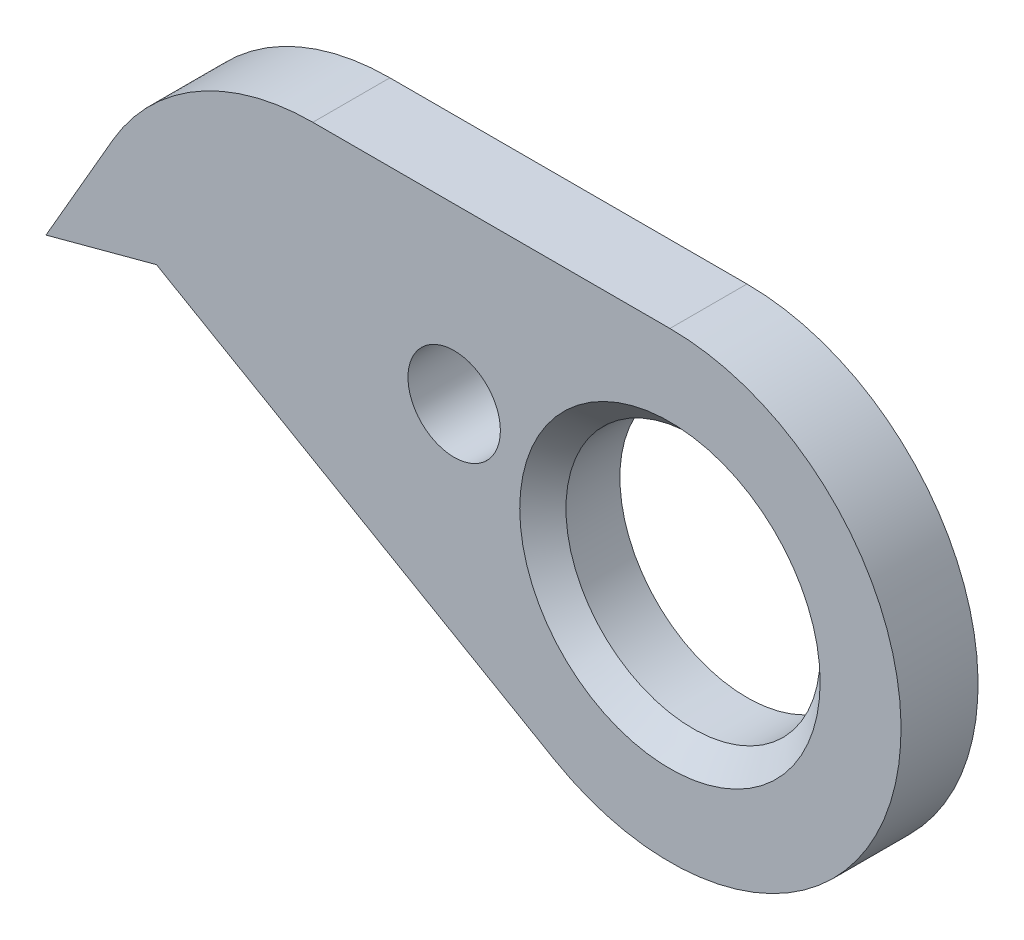
ISO-10303-21;
HEADER;
FILE_DESCRIPTION(('STEP AP214'),'2;1');
FILE_NAME('part.step','',(''),(''),'','','');
FILE_SCHEMA(('AUTOMOTIVE_DESIGN { 1 0 10303 214 1 1 1 1 }'));
ENDSEC;
DATA;
#1=APPLICATION_CONTEXT('core data for automotive mechanical design processes');
#2=APPLICATION_PROTOCOL_DEFINITION('international standard','automotive_design',2000,#1);
#3=PRODUCT_CONTEXT('',#1,'mechanical');
#4=PRODUCT('Part','Part','',(#3));
#5=PRODUCT_RELATED_PRODUCT_CATEGORY('part','',(#4));
#6=PRODUCT_DEFINITION_FORMATION('','',#4);
#7=PRODUCT_DEFINITION_CONTEXT('part definition',#1,'design');
#8=PRODUCT_DEFINITION('design','',#6,#7);
#9=PRODUCT_DEFINITION_SHAPE('','',#8);
#10=(LENGTH_UNIT() NAMED_UNIT(*) SI_UNIT(.MILLI.,.METRE.));
#11=(NAMED_UNIT(*) PLANE_ANGLE_UNIT() SI_UNIT($,.RADIAN.));
#12=(NAMED_UNIT(*) SI_UNIT($,.STERADIAN.) SOLID_ANGLE_UNIT());
#13=UNCERTAINTY_MEASURE_WITH_UNIT(LENGTH_MEASURE(1.E-05),#10,'distance_accuracy_value','');
#14=(GEOMETRIC_REPRESENTATION_CONTEXT(3) GLOBAL_UNCERTAINTY_ASSIGNED_CONTEXT((#13)) GLOBAL_UNIT_ASSIGNED_CONTEXT((#10,
#11,#12)) REPRESENTATION_CONTEXT('',''));
#15=CARTESIAN_POINT('',(0.,0.,0.));
#16=DIRECTION('',(0.,0.,1.));
#17=DIRECTION('',(1.,0.,0.));
#18=AXIS2_PLACEMENT_3D('',#15,#16,#17);
#19=CARTESIAN_POINT('',(0.,0.,-1.));
#20=DIRECTION('',(0.,0.,1.));
#21=DIRECTION('',(1.,0.,0.));
#22=AXIS2_PLACEMENT_3D('',#19,#20,#21);
#23=CYLINDRICAL_SURFACE('',#22,3.);
#24=CARTESIAN_POINT('',(0.,0.,0.));
#25=DIRECTION('',(0.,0.,1.));
#26=DIRECTION('',(1.,0.,0.));
#27=AXIS2_PLACEMENT_3D('',#24,#25,#26);
#28=CIRCLE('',#27,3.);
#29=CARTESIAN_POINT('',(-1.49999999999998,-2.59807621135332,0.));
#30=VERTEX_POINT('',#29);
#31=CARTESIAN_POINT('',(0.,3.,0.));
#32=VERTEX_POINT('',#31);
#33=EDGE_CURVE('E122',#30,#32,#28,.T.);
#34=ORIENTED_EDGE('',*,*,#33,.F.);
#35=DIRECTION('',(0.,0.,1.));
#36=VECTOR('',#35,1.);
#37=CARTESIAN_POINT('',(-1.49999999999998,-2.59807621135332,-1.));
#38=LINE('',#37,#36);
#39=CARTESIAN_POINT('',(-1.49999999999998,-2.59807621135332,-1.));
#40=VERTEX_POINT('',#39);
#41=EDGE_CURVE('E51',#40,#30,#38,.T.);
#42=ORIENTED_EDGE('',*,*,#41,.F.);
#43=CARTESIAN_POINT('',(0.,0.,-1.));
#44=DIRECTION('',(0.,0.,1.));
#45=DIRECTION('',(1.,0.,0.));
#46=AXIS2_PLACEMENT_3D('',#43,#44,#45);
#47=CIRCLE('',#46,3.);
#48=CARTESIAN_POINT('',(0.,3.,-1.));
#49=VERTEX_POINT('',#48);
#50=EDGE_CURVE('E138',#40,#49,#47,.T.);
#51=ORIENTED_EDGE('',*,*,#50,.T.);
#52=DIRECTION('',(0.,0.,1.));
#53=VECTOR('',#52,1.);
#54=CARTESIAN_POINT('',(0.,3.,-1.));
#55=LINE('',#54,#53);
#56=EDGE_CURVE('E86',#49,#32,#55,.T.);
#57=ORIENTED_EDGE('',*,*,#56,.T.);
#58=EDGE_LOOP('',(#34,#42,#51,#57));
#59=FACE_BOUND('',#58,.T.);
#60=ADVANCED_FACE('F34',(#59),#23,.T.);
#61=CARTESIAN_POINT('',(-6.66567332602638,0.38432667397364,-1.));
#62=DIRECTION('',(-0.499999999999995,-0.866025403784442,0.));
#63=DIRECTION('',(0.866025403784442,-0.499999999999995,0.));
#64=AXIS2_PLACEMENT_3D('',#61,#62,#63);
#65=PLANE('',#64);
#66=DIRECTION('',(0.866025403784442,-0.499999999999994,0.));
#67=VECTOR('',#66,1.);
#68=CARTESIAN_POINT('',(-6.66567332602638,0.38432667397364,0.));
#69=LINE('',#68,#67);
#70=CARTESIAN_POINT('',(-6.66567332602638,0.38432667397364,0.));
#71=VERTEX_POINT('',#70);
#72=EDGE_CURVE('E135',#71,#30,#69,.T.);
#73=ORIENTED_EDGE('',*,*,#72,.F.);
#74=DIRECTION('',(0.,0.,1.));
#75=VECTOR('',#74,1.);
#76=CARTESIAN_POINT('',(-6.66567332602638,0.38432667397364,-1.));
#77=LINE('',#76,#75);
#78=CARTESIAN_POINT('',(-6.66567332602638,0.38432667397364,-1.));
#79=VERTEX_POINT('',#78);
#80=EDGE_CURVE('E74',#79,#71,#77,.T.);
#81=ORIENTED_EDGE('',*,*,#80,.F.);
#82=DIRECTION('',(0.866025403784442,-0.499999999999994,0.));
#83=VECTOR('',#82,1.);
#84=CARTESIAN_POINT('',(-6.66567332602638,0.38432667397364,-1.));
#85=LINE('',#84,#83);
#86=EDGE_CURVE('E112',#79,#40,#85,.T.);
#87=ORIENTED_EDGE('',*,*,#86,.T.);
#88=ORIENTED_EDGE('',*,*,#41,.T.);
#89=EDGE_LOOP('',(#73,#81,#87,#88));
#90=FACE_BOUND('',#89,.T.);
#91=ADVANCED_FACE('F163',(#90),#65,.T.);
#92=CARTESIAN_POINT('',(-8.1,0.,-1.));
#93=DIRECTION('',(0.258819045102515,-0.96592582628907,0.));
#94=DIRECTION('',(0.96592582628907,0.258819045102515,0.));
#95=AXIS2_PLACEMENT_3D('',#92,#93,#94);
#96=PLANE('',#95);
#97=DIRECTION('',(0.96592582628907,0.258819045102515,0.));
#98=VECTOR('',#97,1.);
#99=CARTESIAN_POINT('',(-8.1,0.,0.));
#100=LINE('',#99,#98);
#101=CARTESIAN_POINT('',(-8.1,0.,0.));
#102=VERTEX_POINT('',#101);
#103=EDGE_CURVE('E99',#102,#71,#100,.T.);
#104=ORIENTED_EDGE('',*,*,#103,.F.);
#105=DIRECTION('',(0.,0.,1.));
#106=VECTOR('',#105,1.);
#107=CARTESIAN_POINT('',(-8.1,0.,-1.));
#108=LINE('',#107,#106);
#109=CARTESIAN_POINT('',(-8.1,0.,-1.));
#110=VERTEX_POINT('',#109);
#111=EDGE_CURVE('E94',#110,#102,#108,.T.);
#112=ORIENTED_EDGE('',*,*,#111,.F.);
#113=DIRECTION('',(0.96592582628907,0.258819045102515,0.));
#114=VECTOR('',#113,1.);
#115=CARTESIAN_POINT('',(-8.1,0.,-1.));
#116=LINE('',#115,#114);
#117=EDGE_CURVE('E97',#110,#79,#116,.T.);
#118=ORIENTED_EDGE('',*,*,#117,.T.);
#119=ORIENTED_EDGE('',*,*,#80,.T.);
#120=EDGE_LOOP('',(#104,#112,#118,#119));
#121=FACE_BOUND('',#120,.T.);
#122=ADVANCED_FACE('F96',(#121),#96,.T.);
#123=CARTESIAN_POINT('',(-8.1,0.,-1.));
#124=DIRECTION('',(-0.866025403784436,0.500000000000004,0.));
#125=DIRECTION('',(-0.500000000000004,-0.866025403784436,0.));
#126=AXIS2_PLACEMENT_3D('',#123,#124,#125);
#127=PLANE('',#126);
#128=DIRECTION('',(-0.500000000000004,-0.866025403784436,0.));
#129=VECTOR('',#128,1.);
#130=CARTESIAN_POINT('',(-8.1,0.,0.));
#131=LINE('',#130,#129);
#132=CARTESIAN_POINT('',(-7.23397459621554,1.50000000000001,0.));
#133=VERTEX_POINT('',#132);
#134=EDGE_CURVE('E132',#133,#102,#131,.T.);
#135=ORIENTED_EDGE('',*,*,#134,.F.);
#136=DIRECTION('',(0.,0.,1.));
#137=VECTOR('',#136,1.);
#138=CARTESIAN_POINT('',(-7.23397459621554,1.50000000000001,-1.));
#139=LINE('',#138,#137);
#140=CARTESIAN_POINT('',(-7.23397459621554,1.50000000000001,-1.));
#141=VERTEX_POINT('',#140);
#142=EDGE_CURVE('E104',#141,#133,#139,.T.);
#143=ORIENTED_EDGE('',*,*,#142,.F.);
#144=DIRECTION('',(-0.500000000000004,-0.866025403784436,0.));
#145=VECTOR('',#144,1.);
#146=CARTESIAN_POINT('',(-8.1,0.,-1.));
#147=LINE('',#146,#145);
#148=EDGE_CURVE('E110',#141,#110,#147,.T.);
#149=ORIENTED_EDGE('',*,*,#148,.T.);
#150=ORIENTED_EDGE('',*,*,#111,.T.);
#151=EDGE_LOOP('',(#135,#143,#149,#150));
#152=FACE_BOUND('',#151,.T.);
#153=ADVANCED_FACE('F114',(#152),#127,.T.);
#154=CARTESIAN_POINT('',(-4.63589838486224,0.,-1.));
#155=DIRECTION('',(0.,0.,1.));
#156=DIRECTION('',(1.,0.,0.));
#157=AXIS2_PLACEMENT_3D('',#154,#155,#156);
#158=CYLINDRICAL_SURFACE('',#157,3.);
#159=CARTESIAN_POINT('',(-4.63589838486224,0.,0.));
#160=DIRECTION('',(0.,0.,1.));
#161=DIRECTION('',(-1.,0.,0.));
#162=AXIS2_PLACEMENT_3D('',#159,#160,#161);
#163=CIRCLE('',#162,3.);
#164=CARTESIAN_POINT('',(-4.63589838486224,3.,0.));
#165=VERTEX_POINT('',#164);
#166=EDGE_CURVE('E129',#165,#133,#163,.T.);
#167=ORIENTED_EDGE('',*,*,#166,.F.);
#168=DIRECTION('',(0.,0.,1.));
#169=VECTOR('',#168,1.);
#170=CARTESIAN_POINT('',(-4.63589838486224,3.,-1.));
#171=LINE('',#170,#169);
#172=CARTESIAN_POINT('',(-4.63589838486224,3.,-1.));
#173=VERTEX_POINT('',#172);
#174=EDGE_CURVE('E142',#173,#165,#171,.T.);
#175=ORIENTED_EDGE('',*,*,#174,.F.);
#176=CARTESIAN_POINT('',(-4.63589838486224,0.,-1.));
#177=DIRECTION('',(0.,0.,1.));
#178=DIRECTION('',(-1.,0.,0.));
#179=AXIS2_PLACEMENT_3D('',#176,#177,#178);
#180=CIRCLE('',#179,3.);
#181=EDGE_CURVE('E115',#173,#141,#180,.T.);
#182=ORIENTED_EDGE('',*,*,#181,.T.);
#183=ORIENTED_EDGE('',*,*,#142,.T.);
#184=EDGE_LOOP('',(#167,#175,#182,#183));
#185=FACE_BOUND('',#184,.T.);
#186=ADVANCED_FACE('F172',(#185),#158,.T.);
#187=CARTESIAN_POINT('',(0.,3.,-1.));
#188=DIRECTION('',(0.,1.,0.));
#189=DIRECTION('',(-1.,0.,0.));
#190=AXIS2_PLACEMENT_3D('',#187,#188,#189);
#191=PLANE('',#190);
#192=DIRECTION('',(-1.,0.,0.));
#193=VECTOR('',#192,1.);
#194=CARTESIAN_POINT('',(0.,3.,0.));
#195=LINE('',#194,#193);
#196=EDGE_CURVE('E125',#32,#165,#195,.T.);
#197=ORIENTED_EDGE('',*,*,#196,.F.);
#198=ORIENTED_EDGE('',*,*,#56,.F.);
#199=DIRECTION('',(-1.,0.,0.));
#200=VECTOR('',#199,1.);
#201=CARTESIAN_POINT('',(0.,3.,-1.));
#202=LINE('',#201,#200);
#203=EDGE_CURVE('E117',#49,#173,#202,.T.);
#204=ORIENTED_EDGE('',*,*,#203,.T.);
#205=ORIENTED_EDGE('',*,*,#174,.T.);
#206=EDGE_LOOP('',(#197,#198,#204,#205));
#207=FACE_BOUND('',#206,.T.);
#208=ADVANCED_FACE('F169',(#207),#191,.T.);
#209=CARTESIAN_POINT('',(0.,0.,-1.));
#210=DIRECTION('',(0.,0.,1.));
#211=DIRECTION('',(1.,0.,0.));
#212=AXIS2_PLACEMENT_3D('',#209,#210,#211);
#213=PLANE('',#212);
#214=CARTESIAN_POINT('',(-2.8011848962383,0.750575230797312,-1.));
#215=DIRECTION('',(0.,0.,1.));
#216=DIRECTION('',(1.,0.,0.));
#217=AXIS2_PLACEMENT_3D('',#214,#215,#216);
#218=CIRCLE('',#217,0.599999999999999);
#219=CARTESIAN_POINT('',(-2.2011848962383,0.750575230797312,-1.));
#220=VERTEX_POINT('',#219);
#221=EDGE_CURVE('E190',#220,#220,#218,.T.);
#222=ORIENTED_EDGE('',*,*,#221,.T.);
#223=EDGE_LOOP('',(#222));
#224=FACE_BOUND('',#223,.T.);
#225=CARTESIAN_POINT('',(0.,0.,-1.));
#226=DIRECTION('',(0.,0.,1.));
#227=DIRECTION('',(1.,0.,0.));
#228=AXIS2_PLACEMENT_3D('',#225,#226,#227);
#229=CIRCLE('',#228,1.65);
#230=CARTESIAN_POINT('',(1.65,0.,-1.));
#231=VERTEX_POINT('',#230);
#232=EDGE_CURVE('E126',#231,#231,#229,.F.);
#233=ORIENTED_EDGE('',*,*,#232,.F.);
#234=EDGE_LOOP('',(#233));
#235=FACE_BOUND('',#234,.T.);
#236=ORIENTED_EDGE('',*,*,#50,.F.);
#237=ORIENTED_EDGE('',*,*,#86,.F.);
#238=ORIENTED_EDGE('',*,*,#117,.F.);
#239=ORIENTED_EDGE('',*,*,#148,.F.);
#240=ORIENTED_EDGE('',*,*,#181,.F.);
#241=ORIENTED_EDGE('',*,*,#203,.F.);
#242=EDGE_LOOP('',(#236,#237,#238,#239,#240,#241));
#243=FACE_BOUND('',#242,.T.);
#244=ADVANCED_FACE('F108',(#224,#235,#243),#213,.F.);
#245=CARTESIAN_POINT('',(0.,0.,0.));
#246=DIRECTION('',(0.,0.,1.));
#247=DIRECTION('',(1.,0.,0.));
#248=AXIS2_PLACEMENT_3D('',#245,#246,#247);
#249=PLANE('',#248);
#250=CARTESIAN_POINT('',(-2.8011848962383,0.750575230797312,0.));
#251=DIRECTION('',(0.,0.,1.));
#252=DIRECTION('',(1.,0.,0.));
#253=AXIS2_PLACEMENT_3D('',#250,#251,#252);
#254=CIRCLE('',#253,0.599999999999999);
#255=CARTESIAN_POINT('',(-2.2011848962383,0.750575230797312,0.));
#256=VERTEX_POINT('',#255);
#257=EDGE_CURVE('E194',#256,#256,#254,.T.);
#258=ORIENTED_EDGE('',*,*,#257,.F.);
#259=EDGE_LOOP('',(#258));
#260=FACE_BOUND('',#259,.T.);
#261=CARTESIAN_POINT('',(0.,0.,0.));
#262=DIRECTION('',(0.,0.,1.));
#263=DIRECTION('',(1.,0.,0.));
#264=AXIS2_PLACEMENT_3D('',#261,#262,#263);
#265=CIRCLE('',#264,1.95);
#266=CARTESIAN_POINT('',(1.95,0.,0.));
#267=VERTEX_POINT('',#266);
#268=EDGE_CURVE('E11',#267,#267,#265,.F.);
#269=ORIENTED_EDGE('',*,*,#268,.T.);
#270=EDGE_LOOP('',(#269));
#271=FACE_BOUND('',#270,.T.);
#272=ORIENTED_EDGE('',*,*,#33,.T.);
#273=ORIENTED_EDGE('',*,*,#196,.T.);
#274=ORIENTED_EDGE('',*,*,#166,.T.);
#275=ORIENTED_EDGE('',*,*,#134,.T.);
#276=ORIENTED_EDGE('',*,*,#103,.T.);
#277=ORIENTED_EDGE('',*,*,#72,.T.);
#278=EDGE_LOOP('',(#272,#273,#274,#275,#276,#277));
#279=FACE_BOUND('',#278,.T.);
#280=ADVANCED_FACE('F159',(#260,#271,#279),#249,.T.);
#281=CARTESIAN_POINT('',(0.,0.,-1.001));
#282=DIRECTION('',(0.,0.,1.));
#283=DIRECTION('',(1.,0.,0.));
#284=AXIS2_PLACEMENT_3D('',#281,#282,#283);
#285=CYLINDRICAL_SURFACE('',#284,1.65);
#286=CARTESIAN_POINT('',(0.,0.,-0.299999999999999));
#287=DIRECTION('',(0.,0.,1.));
#288=DIRECTION('',(1.,0.,0.));
#289=AXIS2_PLACEMENT_3D('',#286,#287,#288);
#290=CIRCLE('',#289,1.65);
#291=CARTESIAN_POINT('',(1.65,0.,-0.299999999999999));
#292=VERTEX_POINT('',#291);
#293=EDGE_CURVE('E43',#292,#292,#290,.T.);
#294=ORIENTED_EDGE('',*,*,#293,.T.);
#295=EDGE_LOOP('',(#294));
#296=FACE_BOUND('',#295,.T.);
#297=ORIENTED_EDGE('',*,*,#232,.T.);
#298=EDGE_LOOP('',(#297));
#299=FACE_BOUND('',#298,.T.);
#300=ADVANCED_FACE('F147',(#296,#299),#285,.F.);
#301=CARTESIAN_POINT('',(0.,0.,-0.299999999999999));
#302=DIRECTION('',(0.,0.,1.));
#303=DIRECTION('',(1.,0.,0.));
#304=AXIS2_PLACEMENT_3D('',#301,#302,#303);
#305=CONICAL_SURFACE('',#304,1.65,0.78539816339745);
#306=ORIENTED_EDGE('',*,*,#268,.F.);
#307=EDGE_LOOP('',(#306));
#308=FACE_BOUND('',#307,.T.);
#309=ORIENTED_EDGE('',*,*,#293,.F.);
#310=EDGE_LOOP('',(#309));
#311=FACE_BOUND('',#310,.T.);
#312=ADVANCED_FACE('F36',(#308,#311),#305,.F.);
#313=CARTESIAN_POINT('',(-2.8011848962383,0.750575230797312,0.));
#314=DIRECTION('',(0.,0.,1.));
#315=DIRECTION('',(1.,0.,0.));
#316=AXIS2_PLACEMENT_3D('',#313,#314,#315);
#317=CYLINDRICAL_SURFACE('',#316,0.599999999999999);
#318=ORIENTED_EDGE('',*,*,#221,.F.);
#319=EDGE_LOOP('',(#318));
#320=FACE_BOUND('',#319,.T.);
#321=ORIENTED_EDGE('',*,*,#257,.T.);
#322=EDGE_LOOP('',(#321));
#323=FACE_BOUND('',#322,.T.);
#324=ADVANCED_FACE('F151',(#320,#323),#317,.F.);
#325=CLOSED_SHELL('',(#60,#91,#122,#153,#186,#208,#244,#280,#300,#312,#324));
#326=MANIFOLD_SOLID_BREP('B2',#325);
#327=ADVANCED_BREP_SHAPE_REPRESENTATION('',(#18,#326),#14);
#328=SHAPE_DEFINITION_REPRESENTATION(#9,#327);
ENDSEC;
END-ISO-10303-21;
